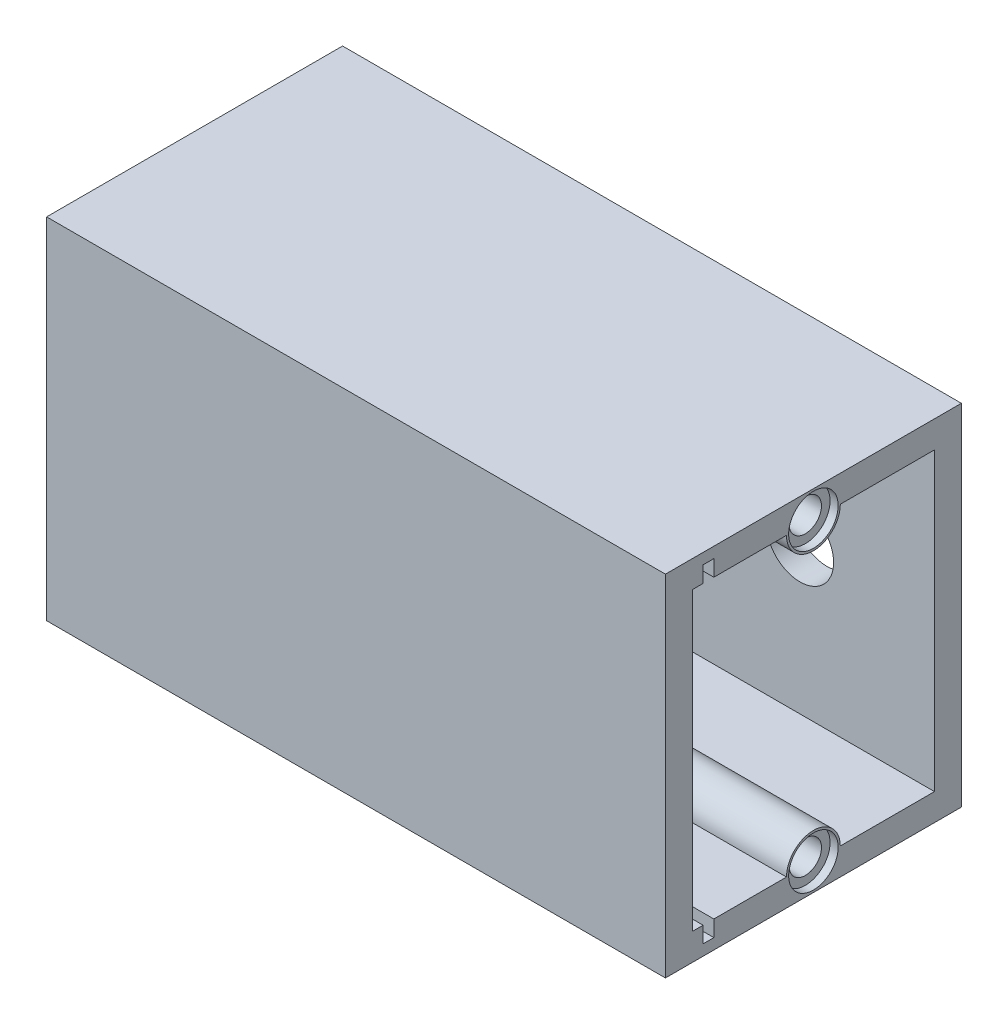
ISO-10303-21;
HEADER;
FILE_DESCRIPTION(('STEP AP214'),'2;1');
FILE_NAME('part.step','',(''),(''),'','','');
FILE_SCHEMA(('AUTOMOTIVE_DESIGN { 1 0 10303 214 1 1 1 1 }'));
ENDSEC;
DATA;
#1=APPLICATION_CONTEXT('core data for automotive mechanical design processes');
#2=APPLICATION_PROTOCOL_DEFINITION('international standard','automotive_design',2000,#1);
#3=PRODUCT_CONTEXT('',#1,'mechanical');
#4=PRODUCT('Part','Part','',(#3));
#5=PRODUCT_RELATED_PRODUCT_CATEGORY('part','',(#4));
#6=PRODUCT_DEFINITION_FORMATION('','',#4);
#7=PRODUCT_DEFINITION_CONTEXT('part definition',#1,'design');
#8=PRODUCT_DEFINITION('design','',#6,#7);
#9=PRODUCT_DEFINITION_SHAPE('','',#8);
#10=(LENGTH_UNIT() NAMED_UNIT(*) SI_UNIT(.MILLI.,.METRE.));
#11=(NAMED_UNIT(*) PLANE_ANGLE_UNIT() SI_UNIT($,.RADIAN.));
#12=(NAMED_UNIT(*) SI_UNIT($,.STERADIAN.) SOLID_ANGLE_UNIT());
#13=UNCERTAINTY_MEASURE_WITH_UNIT(LENGTH_MEASURE(1.E-05),#10,'distance_accuracy_value','');
#14=(GEOMETRIC_REPRESENTATION_CONTEXT(3) GLOBAL_UNCERTAINTY_ASSIGNED_CONTEXT((#13)) GLOBAL_UNIT_ASSIGNED_CONTEXT((#10,
#11,#12)) REPRESENTATION_CONTEXT('',''));
#15=CARTESIAN_POINT('',(0.,0.,0.));
#16=DIRECTION('',(0.,0.,1.));
#17=DIRECTION('',(1.,0.,0.));
#18=AXIS2_PLACEMENT_3D('',#15,#16,#17);
#19=CARTESIAN_POINT('',(0.,4.99999999999999,50.));
#20=DIRECTION('',(0.,-1.,0.));
#21=DIRECTION('',(1.,0.,0.));
#22=AXIS2_PLACEMENT_3D('',#19,#20,#21);
#23=PLANE('',#22);
#24=DIRECTION('',(0.,0.,-1.));
#25=VECTOR('',#24,1.);
#26=CARTESIAN_POINT('',(5.,4.99999999999999,50.));
#27=LINE('',#26,#25);
#28=CARTESIAN_POINT('',(5.,4.99999999999999,22.5));
#29=VERTEX_POINT('',#28);
#30=CARTESIAN_POINT('',(5.,4.99999999999999,5.));
#31=VERTEX_POINT('',#30);
#32=EDGE_CURVE('E193',#29,#31,#27,.T.);
#33=ORIENTED_EDGE('',*,*,#32,.F.);
#34=DIRECTION('',(1.,0.,0.));
#35=VECTOR('',#34,1.);
#36=CARTESIAN_POINT('',(-6.18033988749891,5.,22.5));
#37=LINE('',#36,#35);
#38=CARTESIAN_POINT('',(115.,5.,22.5));
#39=VERTEX_POINT('',#38);
#40=EDGE_CURVE('E192',#29,#39,#37,.T.);
#41=ORIENTED_EDGE('',*,*,#40,.T.);
#42=DIRECTION('',(0.,0.,-1.));
#43=VECTOR('',#42,1.);
#44=CARTESIAN_POINT('',(115.,5.,50.));
#45=LINE('',#44,#43);
#46=CARTESIAN_POINT('',(115.,5.,5.));
#47=VERTEX_POINT('',#46);
#48=EDGE_CURVE('E174',#39,#47,#45,.T.);
#49=ORIENTED_EDGE('',*,*,#48,.T.);
#50=DIRECTION('',(-1.,0.,0.));
#51=VECTOR('',#50,1.);
#52=CARTESIAN_POINT('',(0.,4.99999999999999,5.));
#53=LINE('',#52,#51);
#54=EDGE_CURVE('E276',#47,#31,#53,.T.);
#55=ORIENTED_EDGE('',*,*,#54,.T.);
#56=EDGE_LOOP('',(#33,#41,#49,#55));
#57=FACE_BOUND('',#56,.T.);
#58=ADVANCED_FACE('F35',(#57),#23,.F.);
#59=CARTESIAN_POINT('',(0.,60.,50.));
#60=DIRECTION('',(0.,1.,0.));
#61=DIRECTION('',(0.,0.,1.));
#62=AXIS2_PLACEMENT_3D('',#59,#60,#61);
#63=PLANE('',#62);
#64=DIRECTION('',(1.,0.,0.));
#65=VECTOR('',#64,1.);
#66=CARTESIAN_POINT('',(-6.18033988749891,60.,32.5));
#67=LINE('',#66,#65);
#68=CARTESIAN_POINT('',(5.,60.,32.5));
#69=VERTEX_POINT('',#68);
#70=CARTESIAN_POINT('',(115.,60.,32.5));
#71=VERTEX_POINT('',#70);
#72=EDGE_CURVE('E198',#69,#71,#67,.T.);
#73=ORIENTED_EDGE('',*,*,#72,.T.);
#74=DIRECTION('',(0.,0.,-1.));
#75=VECTOR('',#74,1.);
#76=CARTESIAN_POINT('',(115.,60.,50.));
#77=LINE('',#76,#75);
#78=CARTESIAN_POINT('',(115.,60.,46.));
#79=VERTEX_POINT('',#78);
#80=EDGE_CURVE('E302',#79,#71,#77,.T.);
#81=ORIENTED_EDGE('',*,*,#80,.F.);
#82=DIRECTION('',(-1.,0.,0.));
#83=VECTOR('',#82,1.);
#84=CARTESIAN_POINT('',(0.,60.,46.));
#85=LINE('',#84,#83);
#86=CARTESIAN_POINT('',(52.75,60.,46.));
#87=VERTEX_POINT('',#86);
#88=EDGE_CURVE('E240',#79,#87,#85,.T.);
#89=ORIENTED_EDGE('',*,*,#88,.T.);
#90=DIRECTION('',(0.,0.,-1.));
#91=VECTOR('',#90,1.);
#92=CARTESIAN_POINT('',(52.75,60.,50.));
#93=LINE('',#92,#91);
#94=CARTESIAN_POINT('',(52.75,60.,48.));
#95=VERTEX_POINT('',#94);
#96=EDGE_CURVE('E11',#95,#87,#93,.T.);
#97=ORIENTED_EDGE('',*,*,#96,.F.);
#98=DIRECTION('',(1.,0.,0.));
#99=VECTOR('',#98,1.);
#100=CARTESIAN_POINT('',(0.,60.,48.));
#101=LINE('',#100,#99);
#102=CARTESIAN_POINT('',(115.,60.,48.));
#103=VERTEX_POINT('',#102);
#104=EDGE_CURVE('E252',#95,#103,#101,.T.);
#105=ORIENTED_EDGE('',*,*,#104,.T.);
#106=CARTESIAN_POINT('',(115.,60.,50.));
#107=VERTEX_POINT('',#106);
#108=EDGE_CURVE('E298',#107,#103,#77,.T.);
#109=ORIENTED_EDGE('',*,*,#108,.F.);
#110=DIRECTION('',(1.,0.,0.));
#111=VECTOR('',#110,1.);
#112=CARTESIAN_POINT('',(0.,60.,50.));
#113=LINE('',#112,#111);
#114=CARTESIAN_POINT('',(5.,60.,50.));
#115=VERTEX_POINT('',#114);
#116=EDGE_CURVE('E283',#115,#107,#113,.T.);
#117=ORIENTED_EDGE('',*,*,#116,.F.);
#118=DIRECTION('',(0.,0.,-1.));
#119=VECTOR('',#118,1.);
#120=CARTESIAN_POINT('',(5.,60.,50.));
#121=LINE('',#120,#119);
#122=EDGE_CURVE('E303',#115,#69,#121,.T.);
#123=ORIENTED_EDGE('',*,*,#122,.T.);
#124=EDGE_LOOP('',(#73,#81,#89,#97,#105,#109,#117,#123));
#125=FACE_BOUND('',#124,.T.);
#126=ADVANCED_FACE('F388',(#125),#63,.F.);
#127=DIRECTION('',(1.,0.,0.));
#128=VECTOR('',#127,1.);
#129=CARTESIAN_POINT('',(-6.18033988749891,60.,22.5));
#130=LINE('',#129,#128);
#131=CARTESIAN_POINT('',(5.,60.,22.5));
#132=VERTEX_POINT('',#131);
#133=CARTESIAN_POINT('',(115.,60.,22.5));
#134=VERTEX_POINT('',#133);
#135=EDGE_CURVE('E201',#132,#134,#130,.T.);
#136=ORIENTED_EDGE('',*,*,#135,.F.);
#137=CARTESIAN_POINT('',(5.,60.,5.));
#138=VERTEX_POINT('',#137);
#139=EDGE_CURVE('E301',#132,#138,#121,.T.);
#140=ORIENTED_EDGE('',*,*,#139,.T.);
#141=DIRECTION('',(1.,0.,0.));
#142=VECTOR('',#141,1.);
#143=CARTESIAN_POINT('',(0.,60.,5.));
#144=LINE('',#143,#142);
#145=CARTESIAN_POINT('',(115.,60.,5.));
#146=VERTEX_POINT('',#145);
#147=EDGE_CURVE('E292',#138,#146,#144,.T.);
#148=ORIENTED_EDGE('',*,*,#147,.T.);
#149=EDGE_CURVE('E297',#134,#146,#77,.T.);
#150=ORIENTED_EDGE('',*,*,#149,.F.);
#151=EDGE_LOOP('',(#136,#140,#148,#150));
#152=FACE_BOUND('',#151,.T.);
#153=ADVANCED_FACE('F394',(#152),#63,.F.);
#154=CARTESIAN_POINT('',(0.,0.,0.));
#155=DIRECTION('',(0.,0.,-1.));
#156=DIRECTION('',(-1.,0.,0.));
#157=AXIS2_PLACEMENT_3D('',#154,#155,#156);
#158=PLANE('',#157);
#159=CARTESIAN_POINT('',(30.,32.5,0.));
#160=DIRECTION('',(0.,0.,1.));
#161=DIRECTION('',(1.,0.,0.));
#162=AXIS2_PLACEMENT_3D('',#159,#160,#161);
#163=CIRCLE('',#162,6.25);
#164=CARTESIAN_POINT('',(36.25,32.5,0.));
#165=VERTEX_POINT('',#164);
#166=EDGE_CURVE('E312',#165,#165,#163,.T.);
#167=ORIENTED_EDGE('',*,*,#166,.T.);
#168=EDGE_LOOP('',(#167));
#169=FACE_BOUND('',#168,.T.);
#170=CARTESIAN_POINT('',(90.,32.5,0.));
#171=DIRECTION('',(0.,0.,1.));
#172=DIRECTION('',(1.,0.,0.));
#173=AXIS2_PLACEMENT_3D('',#170,#171,#172);
#174=CIRCLE('',#173,6.25);
#175=CARTESIAN_POINT('',(96.25,32.5,0.));
#176=VERTEX_POINT('',#175);
#177=EDGE_CURVE('E308',#176,#176,#174,.T.);
#178=ORIENTED_EDGE('',*,*,#177,.T.);
#179=EDGE_LOOP('',(#178));
#180=FACE_BOUND('',#179,.T.);
#181=DIRECTION('',(-1.,0.,0.));
#182=VECTOR('',#181,1.);
#183=CARTESIAN_POINT('',(0.,65.,0.));
#184=LINE('',#183,#182);
#185=CARTESIAN_POINT('',(115.,65.,0.));
#186=VERTEX_POINT('',#185);
#187=CARTESIAN_POINT('',(0.,65.,0.));
#188=VERTEX_POINT('',#187);
#189=EDGE_CURVE('E326',#186,#188,#184,.T.);
#190=ORIENTED_EDGE('',*,*,#189,.F.);
#191=DIRECTION('',(0.,1.,0.));
#192=VECTOR('',#191,1.);
#193=CARTESIAN_POINT('',(115.,65.,0.));
#194=LINE('',#193,#192);
#195=CARTESIAN_POINT('',(115.,0.,0.));
#196=VERTEX_POINT('',#195);
#197=EDGE_CURVE('E264',#196,#186,#194,.T.);
#198=ORIENTED_EDGE('',*,*,#197,.F.);
#199=DIRECTION('',(1.,0.,0.));
#200=VECTOR('',#199,1.);
#201=CARTESIAN_POINT('',(0.,0.,0.));
#202=LINE('',#201,#200);
#203=CARTESIAN_POINT('',(0.,0.,0.));
#204=VERTEX_POINT('',#203);
#205=EDGE_CURVE('E323',#204,#196,#202,.T.);
#206=ORIENTED_EDGE('',*,*,#205,.F.);
#207=DIRECTION('',(0.,-1.,0.));
#208=VECTOR('',#207,1.);
#209=CARTESIAN_POINT('',(0.,0.,0.));
#210=LINE('',#209,#208);
#211=EDGE_CURVE('E318',#188,#204,#210,.T.);
#212=ORIENTED_EDGE('',*,*,#211,.F.);
#213=EDGE_LOOP('',(#190,#198,#206,#212));
#214=FACE_BOUND('',#213,.T.);
#215=ADVANCED_FACE('F553',(#169,#180,#214),#158,.T.);
#216=CARTESIAN_POINT('',(0.,0.,5.));
#217=DIRECTION('',(0.,1.,0.));
#218=DIRECTION('',(0.,0.,1.));
#219=AXIS2_PLACEMENT_3D('',#216,#217,#218);
#220=PLANE('',#219);
#221=DIRECTION('',(0.,0.,-1.));
#222=VECTOR('',#221,1.);
#223=CARTESIAN_POINT('',(115.,0.,55.));
#224=LINE('',#223,#222);
#225=CARTESIAN_POINT('',(115.,0.,55.));
#226=VERTEX_POINT('',#225);
#227=EDGE_CURVE('E262',#226,#196,#224,.T.);
#228=ORIENTED_EDGE('',*,*,#227,.F.);
#229=DIRECTION('',(1.,0.,0.));
#230=VECTOR('',#229,1.);
#231=CARTESIAN_POINT('',(0.,0.,55.));
#232=LINE('',#231,#230);
#233=CARTESIAN_POINT('',(0.,0.,55.));
#234=VERTEX_POINT('',#233);
#235=EDGE_CURVE('E271',#234,#226,#232,.T.);
#236=ORIENTED_EDGE('',*,*,#235,.F.);
#237=DIRECTION('',(0.,0.,-1.));
#238=VECTOR('',#237,1.);
#239=CARTESIAN_POINT('',(0.,0.,5.));
#240=LINE('',#239,#238);
#241=EDGE_CURVE('E331',#234,#204,#240,.T.);
#242=ORIENTED_EDGE('',*,*,#241,.T.);
#243=ORIENTED_EDGE('',*,*,#205,.T.);
#244=EDGE_LOOP('',(#228,#236,#242,#243));
#245=FACE_BOUND('',#244,.T.);
#246=ADVANCED_FACE('F662',(#245),#220,.F.);
#247=CARTESIAN_POINT('',(0.,65.,5.));
#248=DIRECTION('',(0.,-1.,0.));
#249=DIRECTION('',(0.,0.,-1.));
#250=AXIS2_PLACEMENT_3D('',#247,#248,#249);
#251=PLANE('',#250);
#252=DIRECTION('',(0.,0.,1.));
#253=VECTOR('',#252,1.);
#254=CARTESIAN_POINT('',(115.,65.,55.));
#255=LINE('',#254,#253);
#256=CARTESIAN_POINT('',(115.,65.,55.));
#257=VERTEX_POINT('',#256);
#258=EDGE_CURVE('E266',#186,#257,#255,.T.);
#259=ORIENTED_EDGE('',*,*,#258,.F.);
#260=ORIENTED_EDGE('',*,*,#189,.T.);
#261=DIRECTION('',(0.,0.,-1.));
#262=VECTOR('',#261,1.);
#263=CARTESIAN_POINT('',(0.,65.,5.));
#264=LINE('',#263,#262);
#265=CARTESIAN_POINT('',(0.,65.,55.));
#266=VERTEX_POINT('',#265);
#267=EDGE_CURVE('E328',#266,#188,#264,.T.);
#268=ORIENTED_EDGE('',*,*,#267,.F.);
#269=DIRECTION('',(-1.,0.,0.));
#270=VECTOR('',#269,1.);
#271=CARTESIAN_POINT('',(0.,65.,55.));
#272=LINE('',#271,#270);
#273=EDGE_CURVE('E274',#257,#266,#272,.T.);
#274=ORIENTED_EDGE('',*,*,#273,.F.);
#275=EDGE_LOOP('',(#259,#260,#268,#274));
#276=FACE_BOUND('',#275,.T.);
#277=ADVANCED_FACE('F479',(#276),#251,.F.);
#278=CARTESIAN_POINT('',(0.,0.,55.));
#279=DIRECTION('',(0.,0.,1.));
#280=DIRECTION('',(1.,0.,0.));
#281=AXIS2_PLACEMENT_3D('',#278,#279,#280);
#282=PLANE('',#281);
#283=ORIENTED_EDGE('',*,*,#235,.T.);
#284=DIRECTION('',(0.,-1.,0.));
#285=VECTOR('',#284,1.);
#286=CARTESIAN_POINT('',(115.,65.,55.));
#287=LINE('',#286,#285);
#288=EDGE_CURVE('E260',#257,#226,#287,.T.);
#289=ORIENTED_EDGE('',*,*,#288,.F.);
#290=ORIENTED_EDGE('',*,*,#273,.T.);
#291=DIRECTION('',(0.,-1.,0.));
#292=VECTOR('',#291,1.);
#293=CARTESIAN_POINT('',(0.,65.,55.));
#294=LINE('',#293,#292);
#295=EDGE_CURVE('E268',#266,#234,#294,.T.);
#296=ORIENTED_EDGE('',*,*,#295,.T.);
#297=EDGE_LOOP('',(#283,#289,#290,#296));
#298=FACE_BOUND('',#297,.T.);
#299=ADVANCED_FACE('F476',(#298),#282,.T.);
#300=CARTESIAN_POINT('',(0.,0.,5.));
#301=DIRECTION('',(0.,0.,-1.));
#302=DIRECTION('',(-1.,0.,0.));
#303=AXIS2_PLACEMENT_3D('',#300,#301,#302);
#304=PLANE('',#303);
#305=CARTESIAN_POINT('',(90.,32.5,5.));
#306=DIRECTION('',(0.,0.,1.));
#307=DIRECTION('',(1.,0.,0.));
#308=AXIS2_PLACEMENT_3D('',#305,#306,#307);
#309=CIRCLE('',#308,6.25);
#310=CARTESIAN_POINT('',(96.25,32.5,5.));
#311=VERTEX_POINT('',#310);
#312=EDGE_CURVE('E309',#311,#311,#309,.T.);
#313=ORIENTED_EDGE('',*,*,#312,.F.);
#314=EDGE_LOOP('',(#313));
#315=FACE_BOUND('',#314,.T.);
#316=CARTESIAN_POINT('',(30.,32.5,5.));
#317=DIRECTION('',(0.,0.,1.));
#318=DIRECTION('',(1.,0.,0.));
#319=AXIS2_PLACEMENT_3D('',#316,#317,#318);
#320=CIRCLE('',#319,6.25);
#321=CARTESIAN_POINT('',(36.25,32.5,5.));
#322=VERTEX_POINT('',#321);
#323=EDGE_CURVE('E315',#322,#322,#320,.T.);
#324=ORIENTED_EDGE('',*,*,#323,.F.);
#325=EDGE_LOOP('',(#324));
#326=FACE_BOUND('',#325,.T.);
#327=ORIENTED_EDGE('',*,*,#54,.F.);
#328=DIRECTION('',(0.,-1.,0.));
#329=VECTOR('',#328,1.);
#330=CARTESIAN_POINT('',(115.,0.,5.));
#331=LINE('',#330,#329);
#332=EDGE_CURVE('E183',#146,#47,#331,.T.);
#333=ORIENTED_EDGE('',*,*,#332,.F.);
#334=ORIENTED_EDGE('',*,*,#147,.F.);
#335=DIRECTION('',(0.,1.,0.));
#336=VECTOR('',#335,1.);
#337=CARTESIAN_POINT('',(5.,0.,5.));
#338=LINE('',#337,#336);
#339=EDGE_CURVE('E289',#31,#138,#338,.T.);
#340=ORIENTED_EDGE('',*,*,#339,.F.);
#341=EDGE_LOOP('',(#327,#333,#334,#340));
#342=FACE_BOUND('',#341,.T.);
#343=ADVANCED_FACE('F448',(#315,#326,#342),#304,.F.);
#344=CARTESIAN_POINT('',(0.,0.,5.));
#345=DIRECTION('',(1.,0.,0.));
#346=DIRECTION('',(0.,0.,-1.));
#347=AXIS2_PLACEMENT_3D('',#344,#345,#346);
#348=PLANE('',#347);
#349=ORIENTED_EDGE('',*,*,#211,.T.);
#350=ORIENTED_EDGE('',*,*,#241,.F.);
#351=ORIENTED_EDGE('',*,*,#295,.F.);
#352=ORIENTED_EDGE('',*,*,#267,.T.);
#353=EDGE_LOOP('',(#349,#350,#351,#352));
#354=FACE_BOUND('',#353,.T.);
#355=ADVANCED_FACE('F37',(#354),#348,.F.);
#356=CARTESIAN_POINT('',(30.,32.5,5.));
#357=DIRECTION('',(0.,0.,-1.));
#358=DIRECTION('',(-1.,0.,0.));
#359=AXIS2_PLACEMENT_3D('',#356,#357,#358);
#360=CYLINDRICAL_SURFACE('',#359,6.25);
#361=ORIENTED_EDGE('',*,*,#323,.T.);
#362=EDGE_LOOP('',(#361));
#363=FACE_BOUND('',#362,.T.);
#364=ORIENTED_EDGE('',*,*,#166,.F.);
#365=EDGE_LOOP('',(#364));
#366=FACE_BOUND('',#365,.T.);
#367=ADVANCED_FACE('F407',(#363,#366),#360,.F.);
#368=CARTESIAN_POINT('',(90.,32.5,5.));
#369=DIRECTION('',(0.,0.,-1.));
#370=DIRECTION('',(-1.,0.,0.));
#371=AXIS2_PLACEMENT_3D('',#368,#369,#370);
#372=CYLINDRICAL_SURFACE('',#371,6.25);
#373=ORIENTED_EDGE('',*,*,#312,.T.);
#374=EDGE_LOOP('',(#373));
#375=FACE_BOUND('',#374,.T.);
#376=ORIENTED_EDGE('',*,*,#177,.F.);
#377=EDGE_LOOP('',(#376));
#378=FACE_BOUND('',#377,.T.);
#379=ADVANCED_FACE('F401',(#375,#378),#372,.F.);
#380=CARTESIAN_POINT('',(115.,5.00000000000001,46.));
#381=VERTEX_POINT('',#380);
#382=CARTESIAN_POINT('',(115.,5.,32.5));
#383=VERTEX_POINT('',#382);
#384=EDGE_CURVE('E187',#381,#383,#45,.T.);
#385=ORIENTED_EDGE('',*,*,#384,.T.);
#386=DIRECTION('',(1.,0.,0.));
#387=VECTOR('',#386,1.);
#388=CARTESIAN_POINT('',(-6.18033988749891,5.,32.5));
#389=LINE('',#388,#387);
#390=CARTESIAN_POINT('',(5.,4.99999999999999,32.5));
#391=VERTEX_POINT('',#390);
#392=EDGE_CURVE('E60',#391,#383,#389,.T.);
#393=ORIENTED_EDGE('',*,*,#392,.F.);
#394=CARTESIAN_POINT('',(5.,4.99999999999999,50.));
#395=VERTEX_POINT('',#394);
#396=EDGE_CURVE('E306',#395,#391,#27,.T.);
#397=ORIENTED_EDGE('',*,*,#396,.F.);
#398=DIRECTION('',(-1.,0.,0.));
#399=VECTOR('',#398,1.);
#400=CARTESIAN_POINT('',(0.,4.99999999999999,50.));
#401=LINE('',#400,#399);
#402=CARTESIAN_POINT('',(115.,5.,50.));
#403=VERTEX_POINT('',#402);
#404=EDGE_CURVE('E277',#403,#395,#401,.T.);
#405=ORIENTED_EDGE('',*,*,#404,.F.);
#406=CARTESIAN_POINT('',(115.,5.00000000000001,48.));
#407=VERTEX_POINT('',#406);
#408=EDGE_CURVE('E190',#403,#407,#45,.T.);
#409=ORIENTED_EDGE('',*,*,#408,.T.);
#410=DIRECTION('',(-1.,0.,0.));
#411=VECTOR('',#410,1.);
#412=CARTESIAN_POINT('',(0.,4.99999999999999,48.));
#413=LINE('',#412,#411);
#414=CARTESIAN_POINT('',(52.75,5.,48.));
#415=VERTEX_POINT('',#414);
#416=EDGE_CURVE('E255',#407,#415,#413,.T.);
#417=ORIENTED_EDGE('',*,*,#416,.T.);
#418=DIRECTION('',(0.,0.,1.));
#419=VECTOR('',#418,1.);
#420=CARTESIAN_POINT('',(52.75,4.99999999999999,50.));
#421=LINE('',#420,#419);
#422=CARTESIAN_POINT('',(52.75,5.,46.));
#423=VERTEX_POINT('',#422);
#424=EDGE_CURVE('E258',#423,#415,#421,.T.);
#425=ORIENTED_EDGE('',*,*,#424,.F.);
#426=DIRECTION('',(1.,0.,0.));
#427=VECTOR('',#426,1.);
#428=CARTESIAN_POINT('',(0.,4.99999999999999,46.));
#429=LINE('',#428,#427);
#430=EDGE_CURVE('E249',#423,#381,#429,.T.);
#431=ORIENTED_EDGE('',*,*,#430,.T.);
#432=EDGE_LOOP('',(#385,#393,#397,#405,#409,#417,#425,#431));
#433=FACE_BOUND('',#432,.T.);
#434=ADVANCED_FACE('F390',(#433),#23,.F.);
#435=CARTESIAN_POINT('',(5.,0.,50.));
#436=DIRECTION('',(-1.,0.,0.));
#437=DIRECTION('',(0.,-1.,0.));
#438=AXIS2_PLACEMENT_3D('',#435,#436,#437);
#439=PLANE('',#438);
#440=ORIENTED_EDGE('',*,*,#396,.T.);
#441=CARTESIAN_POINT('',(5.,5.,27.5));
#442=DIRECTION('',(-1.,0.,0.));
#443=DIRECTION('',(0.,-1.,0.));
#444=AXIS2_PLACEMENT_3D('',#441,#442,#443);
#445=CIRCLE('',#444,5.);
#446=EDGE_CURVE('E52',#29,#391,#445,.F.);
#447=ORIENTED_EDGE('',*,*,#446,.F.);
#448=ORIENTED_EDGE('',*,*,#32,.T.);
#449=ORIENTED_EDGE('',*,*,#339,.T.);
#450=ORIENTED_EDGE('',*,*,#139,.F.);
#451=CARTESIAN_POINT('',(5.,60.,27.5));
#452=DIRECTION('',(-1.,0.,0.));
#453=DIRECTION('',(0.,-1.,0.));
#454=AXIS2_PLACEMENT_3D('',#451,#452,#453);
#455=CIRCLE('',#454,5.);
#456=EDGE_CURVE('E208',#132,#69,#455,.T.);
#457=ORIENTED_EDGE('',*,*,#456,.T.);
#458=ORIENTED_EDGE('',*,*,#122,.F.);
#459=DIRECTION('',(0.,1.,0.));
#460=VECTOR('',#459,1.);
#461=CARTESIAN_POINT('',(5.,0.,50.));
#462=LINE('',#461,#460);
#463=EDGE_CURVE('E280',#395,#115,#462,.T.);
#464=ORIENTED_EDGE('',*,*,#463,.F.);
#465=EDGE_LOOP('',(#440,#447,#448,#449,#450,#457,#458,#464));
#466=FACE_BOUND('',#465,.T.);
#467=ADVANCED_FACE('F400',(#466),#439,.F.);
#468=CARTESIAN_POINT('',(0.,0.,50.));
#469=DIRECTION('',(0.,0.,1.));
#470=DIRECTION('',(1.,0.,0.));
#471=AXIS2_PLACEMENT_3D('',#468,#469,#470);
#472=PLANE('',#471);
#473=DIRECTION('',(0.,-1.,0.));
#474=VECTOR('',#473,1.);
#475=CARTESIAN_POINT('',(115.,0.,50.));
#476=LINE('',#475,#474);
#477=EDGE_CURVE('E188',#107,#403,#476,.T.);
#478=ORIENTED_EDGE('',*,*,#477,.T.);
#479=ORIENTED_EDGE('',*,*,#404,.T.);
#480=ORIENTED_EDGE('',*,*,#463,.T.);
#481=ORIENTED_EDGE('',*,*,#116,.T.);
#482=EDGE_LOOP('',(#478,#479,#480,#481));
#483=FACE_BOUND('',#482,.T.);
#484=ADVANCED_FACE('F406',(#483),#472,.F.);
#485=CARTESIAN_POINT('',(115.,0.,0.));
#486=DIRECTION('',(1.,0.,0.));
#487=DIRECTION('',(0.,0.,-1.));
#488=AXIS2_PLACEMENT_3D('',#485,#486,#487);
#489=PLANE('',#488);
#490=CARTESIAN_POINT('',(115.,60.,27.5));
#491=DIRECTION('',(1.,0.,0.));
#492=DIRECTION('',(0.,0.,-1.));
#493=AXIS2_PLACEMENT_3D('',#490,#491,#492);
#494=CIRCLE('',#493,4.6);
#495=CARTESIAN_POINT('',(115.,60.,22.9));
#496=VERTEX_POINT('',#495);
#497=EDGE_CURVE('E345',#496,#496,#494,.T.);
#498=ORIENTED_EDGE('',*,*,#497,.F.);
#499=EDGE_LOOP('',(#498));
#500=FACE_BOUND('',#499,.T.);
#501=CARTESIAN_POINT('',(115.,5.,27.5));
#502=DIRECTION('',(1.,0.,0.));
#503=DIRECTION('',(0.,0.,-1.));
#504=AXIS2_PLACEMENT_3D('',#501,#502,#503);
#505=CIRCLE('',#504,4.6);
#506=CARTESIAN_POINT('',(115.,5.,22.9));
#507=VERTEX_POINT('',#506);
#508=EDGE_CURVE('E355',#507,#507,#505,.T.);
#509=ORIENTED_EDGE('',*,*,#508,.F.);
#510=EDGE_LOOP('',(#509));
#511=FACE_BOUND('',#510,.T.);
#512=DIRECTION('',(0.,-1.,0.));
#513=VECTOR('',#512,1.);
#514=CARTESIAN_POINT('',(115.,63.,48.));
#515=LINE('',#514,#513);
#516=CARTESIAN_POINT('',(115.,63.,48.));
#517=VERTEX_POINT('',#516);
#518=EDGE_CURVE('E211',#517,#103,#515,.T.);
#519=ORIENTED_EDGE('',*,*,#518,.F.);
#520=DIRECTION('',(0.,0.,1.));
#521=VECTOR('',#520,1.);
#522=CARTESIAN_POINT('',(115.,63.,48.));
#523=LINE('',#522,#521);
#524=CARTESIAN_POINT('',(115.,63.,46.));
#525=VERTEX_POINT('',#524);
#526=EDGE_CURVE('E235',#525,#517,#523,.T.);
#527=ORIENTED_EDGE('',*,*,#526,.F.);
#528=DIRECTION('',(0.,1.,0.));
#529=VECTOR('',#528,1.);
#530=CARTESIAN_POINT('',(115.,0.,46.));
#531=LINE('',#530,#529);
#532=EDGE_CURVE('E44',#79,#525,#531,.T.);
#533=ORIENTED_EDGE('',*,*,#532,.F.);
#534=ORIENTED_EDGE('',*,*,#80,.T.);
#535=CARTESIAN_POINT('',(115.,60.,27.5));
#536=DIRECTION('',(-1.,0.,0.));
#537=DIRECTION('',(0.,0.,1.));
#538=AXIS2_PLACEMENT_3D('',#535,#536,#537);
#539=CIRCLE('',#538,5.);
#540=EDGE_CURVE('E206',#134,#71,#539,.T.);
#541=ORIENTED_EDGE('',*,*,#540,.F.);
#542=ORIENTED_EDGE('',*,*,#149,.T.);
#543=ORIENTED_EDGE('',*,*,#332,.T.);
#544=ORIENTED_EDGE('',*,*,#48,.F.);
#545=CARTESIAN_POINT('',(115.,5.,27.5));
#546=DIRECTION('',(1.,0.,0.));
#547=DIRECTION('',(0.,0.,-1.));
#548=AXIS2_PLACEMENT_3D('',#545,#546,#547);
#549=CIRCLE('',#548,5.);
#550=EDGE_CURVE('E181',#39,#383,#549,.T.);
#551=ORIENTED_EDGE('',*,*,#550,.T.);
#552=ORIENTED_EDGE('',*,*,#384,.F.);
#553=DIRECTION('',(0.,1.,0.));
#554=VECTOR('',#553,1.);
#555=CARTESIAN_POINT('',(115.,63.,46.));
#556=LINE('',#555,#554);
#557=CARTESIAN_POINT('',(115.,2.,46.));
#558=VERTEX_POINT('',#557);
#559=EDGE_CURVE('E233',#558,#381,#556,.T.);
#560=ORIENTED_EDGE('',*,*,#559,.F.);
#561=DIRECTION('',(0.,0.,-1.));
#562=VECTOR('',#561,1.);
#563=CARTESIAN_POINT('',(115.,2.,48.));
#564=LINE('',#563,#562);
#565=CARTESIAN_POINT('',(115.,2.,48.));
#566=VERTEX_POINT('',#565);
#567=EDGE_CURVE('E230',#566,#558,#564,.T.);
#568=ORIENTED_EDGE('',*,*,#567,.F.);
#569=DIRECTION('',(0.,-1.,0.));
#570=VECTOR('',#569,1.);
#571=CARTESIAN_POINT('',(115.,0.,48.));
#572=LINE('',#571,#570);
#573=EDGE_CURVE('E334',#407,#566,#572,.T.);
#574=ORIENTED_EDGE('',*,*,#573,.F.);
#575=ORIENTED_EDGE('',*,*,#408,.F.);
#576=ORIENTED_EDGE('',*,*,#477,.F.);
#577=ORIENTED_EDGE('',*,*,#108,.T.);
#578=EDGE_LOOP('',(#519,#527,#533,#534,#541,#542,#543,#544,#551,#552,#560,#568,#574,#575,#576,#577));
#579=FACE_BOUND('',#578,.T.);
#580=ORIENTED_EDGE('',*,*,#288,.T.);
#581=ORIENTED_EDGE('',*,*,#227,.T.);
#582=ORIENTED_EDGE('',*,*,#197,.T.);
#583=ORIENTED_EDGE('',*,*,#258,.T.);
#584=EDGE_LOOP('',(#580,#581,#582,#583));
#585=FACE_BOUND('',#584,.T.);
#586=ADVANCED_FACE('F177',(#500,#511,#579,#585),#489,.T.);
#587=CARTESIAN_POINT('',(52.75,2.,48.));
#588=DIRECTION('',(0.,-1.,0.));
#589=DIRECTION('',(0.,0.,-1.));
#590=AXIS2_PLACEMENT_3D('',#587,#588,#589);
#591=PLANE('',#590);
#592=ORIENTED_EDGE('',*,*,#567,.T.);
#593=DIRECTION('',(1.,0.,0.));
#594=VECTOR('',#593,1.);
#595=CARTESIAN_POINT('',(52.75,2.,46.));
#596=LINE('',#595,#594);
#597=CARTESIAN_POINT('',(52.75,2.,46.));
#598=VERTEX_POINT('',#597);
#599=EDGE_CURVE('E244',#598,#558,#596,.T.);
#600=ORIENTED_EDGE('',*,*,#599,.F.);
#601=DIRECTION('',(0.,0.,-1.));
#602=VECTOR('',#601,1.);
#603=CARTESIAN_POINT('',(52.75,2.,48.));
#604=LINE('',#603,#602);
#605=CARTESIAN_POINT('',(52.75,2.,48.));
#606=VERTEX_POINT('',#605);
#607=EDGE_CURVE('E217',#606,#598,#604,.T.);
#608=ORIENTED_EDGE('',*,*,#607,.F.);
#609=DIRECTION('',(1.,0.,0.));
#610=VECTOR('',#609,1.);
#611=CARTESIAN_POINT('',(52.75,2.,48.));
#612=LINE('',#611,#610);
#613=EDGE_CURVE('E228',#606,#566,#612,.T.);
#614=ORIENTED_EDGE('',*,*,#613,.T.);
#615=EDGE_LOOP('',(#592,#600,#608,#614));
#616=FACE_BOUND('',#615,.T.);
#617=ADVANCED_FACE('F418',(#616),#591,.F.);
#618=CARTESIAN_POINT('',(52.75,63.,46.));
#619=DIRECTION('',(0.,0.,-1.));
#620=DIRECTION('',(0.,1.,0.));
#621=AXIS2_PLACEMENT_3D('',#618,#619,#620);
#622=PLANE('',#621);
#623=DIRECTION('',(0.,1.,0.));
#624=VECTOR('',#623,1.);
#625=CARTESIAN_POINT('',(52.75,63.,46.));
#626=LINE('',#625,#624);
#627=EDGE_CURVE('E222',#598,#423,#626,.T.);
#628=ORIENTED_EDGE('',*,*,#627,.F.);
#629=ORIENTED_EDGE('',*,*,#599,.T.);
#630=ORIENTED_EDGE('',*,*,#559,.T.);
#631=ORIENTED_EDGE('',*,*,#430,.F.);
#632=EDGE_LOOP('',(#628,#629,#630,#631));
#633=FACE_BOUND('',#632,.T.);
#634=ADVANCED_FACE('F415',(#633),#622,.F.);
#635=CARTESIAN_POINT('',(52.75,63.,48.));
#636=DIRECTION('',(0.,0.,1.));
#637=DIRECTION('',(0.,-1.,0.));
#638=AXIS2_PLACEMENT_3D('',#635,#636,#637);
#639=PLANE('',#638);
#640=ORIENTED_EDGE('',*,*,#573,.T.);
#641=ORIENTED_EDGE('',*,*,#613,.F.);
#642=DIRECTION('',(0.,-1.,0.));
#643=VECTOR('',#642,1.);
#644=CARTESIAN_POINT('',(52.75,63.,48.));
#645=LINE('',#644,#643);
#646=EDGE_CURVE('E218',#415,#606,#645,.T.);
#647=ORIENTED_EDGE('',*,*,#646,.F.);
#648=ORIENTED_EDGE('',*,*,#416,.F.);
#649=EDGE_LOOP('',(#640,#641,#647,#648));
#650=FACE_BOUND('',#649,.T.);
#651=ADVANCED_FACE('F422',(#650),#639,.F.);
#652=CARTESIAN_POINT('',(52.75,0.,0.));
#653=DIRECTION('',(1.,0.,0.));
#654=DIRECTION('',(0.,0.,-1.));
#655=AXIS2_PLACEMENT_3D('',#652,#653,#654);
#656=PLANE('',#655);
#657=ORIENTED_EDGE('',*,*,#424,.T.);
#658=ORIENTED_EDGE('',*,*,#646,.T.);
#659=ORIENTED_EDGE('',*,*,#607,.T.);
#660=ORIENTED_EDGE('',*,*,#627,.T.);
#661=EDGE_LOOP('',(#657,#658,#659,#660));
#662=FACE_BOUND('',#661,.T.);
#663=ADVANCED_FACE('F463',(#662),#656,.T.);
#664=ORIENTED_EDGE('',*,*,#96,.T.);
#665=CARTESIAN_POINT('',(52.75,63.,46.));
#666=VERTEX_POINT('',#665);
#667=EDGE_CURVE('E221',#87,#666,#626,.T.);
#668=ORIENTED_EDGE('',*,*,#667,.T.);
#669=DIRECTION('',(0.,0.,1.));
#670=VECTOR('',#669,1.);
#671=CARTESIAN_POINT('',(52.75,63.,48.));
#672=LINE('',#671,#670);
#673=CARTESIAN_POINT('',(52.75,63.,48.));
#674=VERTEX_POINT('',#673);
#675=EDGE_CURVE('E225',#666,#674,#672,.T.);
#676=ORIENTED_EDGE('',*,*,#675,.T.);
#677=EDGE_CURVE('E214',#674,#95,#645,.T.);
#678=ORIENTED_EDGE('',*,*,#677,.T.);
#679=EDGE_LOOP('',(#664,#668,#676,#678));
#680=FACE_BOUND('',#679,.T.);
#681=ADVANCED_FACE('F432',(#680),#656,.T.);
#682=ORIENTED_EDGE('',*,*,#677,.F.);
#683=DIRECTION('',(1.,0.,0.));
#684=VECTOR('',#683,1.);
#685=CARTESIAN_POINT('',(52.75,63.,48.));
#686=LINE('',#685,#684);
#687=EDGE_CURVE('E238',#674,#517,#686,.T.);
#688=ORIENTED_EDGE('',*,*,#687,.T.);
#689=ORIENTED_EDGE('',*,*,#518,.T.);
#690=ORIENTED_EDGE('',*,*,#104,.F.);
#691=EDGE_LOOP('',(#682,#688,#689,#690));
#692=FACE_BOUND('',#691,.T.);
#693=ADVANCED_FACE('F430',(#692),#639,.F.);
#694=ORIENTED_EDGE('',*,*,#532,.T.);
#695=DIRECTION('',(1.,0.,0.));
#696=VECTOR('',#695,1.);
#697=CARTESIAN_POINT('',(52.75,63.,46.));
#698=LINE('',#697,#696);
#699=EDGE_CURVE('E241',#666,#525,#698,.T.);
#700=ORIENTED_EDGE('',*,*,#699,.F.);
#701=ORIENTED_EDGE('',*,*,#667,.F.);
#702=ORIENTED_EDGE('',*,*,#88,.F.);
#703=EDGE_LOOP('',(#694,#700,#701,#702));
#704=FACE_BOUND('',#703,.T.);
#705=ADVANCED_FACE('F460',(#704),#622,.F.);
#706=CARTESIAN_POINT('',(52.75,63.,48.));
#707=DIRECTION('',(0.,1.,0.));
#708=DIRECTION('',(0.,0.,1.));
#709=AXIS2_PLACEMENT_3D('',#706,#707,#708);
#710=PLANE('',#709);
#711=ORIENTED_EDGE('',*,*,#526,.T.);
#712=ORIENTED_EDGE('',*,*,#687,.F.);
#713=ORIENTED_EDGE('',*,*,#675,.F.);
#714=ORIENTED_EDGE('',*,*,#699,.T.);
#715=EDGE_LOOP('',(#711,#712,#713,#714));
#716=FACE_BOUND('',#715,.T.);
#717=ADVANCED_FACE('F437',(#716),#710,.F.);
#718=CARTESIAN_POINT('',(-6.18033988749891,60.,27.5));
#719=DIRECTION('',(1.,0.,0.));
#720=DIRECTION('',(0.,0.,-1.));
#721=AXIS2_PLACEMENT_3D('',#718,#719,#720);
#722=CYLINDRICAL_SURFACE('',#721,5.);
#723=ORIENTED_EDGE('',*,*,#456,.F.);
#724=ORIENTED_EDGE('',*,*,#135,.T.);
#725=ORIENTED_EDGE('',*,*,#540,.T.);
#726=ORIENTED_EDGE('',*,*,#72,.F.);
#727=EDGE_LOOP('',(#723,#724,#725,#726));
#728=FACE_BOUND('',#727,.T.);
#729=ADVANCED_FACE('F452',(#728),#722,.T.);
#730=CARTESIAN_POINT('',(-6.18033988749891,5.,27.5));
#731=DIRECTION('',(1.,0.,0.));
#732=DIRECTION('',(0.,0.,-1.));
#733=AXIS2_PLACEMENT_3D('',#730,#731,#732);
#734=CYLINDRICAL_SURFACE('',#733,5.);
#735=ORIENTED_EDGE('',*,*,#40,.F.);
#736=ORIENTED_EDGE('',*,*,#446,.T.);
#737=ORIENTED_EDGE('',*,*,#392,.T.);
#738=ORIENTED_EDGE('',*,*,#550,.F.);
#739=EDGE_LOOP('',(#735,#736,#737,#738));
#740=FACE_BOUND('',#739,.T.);
#741=ADVANCED_FACE('F197',(#740),#734,.T.);
#742=CARTESIAN_POINT('',(113.5,60.,27.5));
#743=DIRECTION('',(1.,0.,0.));
#744=DIRECTION('',(0.,0.,-1.));
#745=AXIS2_PLACEMENT_3D('',#742,#743,#744);
#746=PLANE('',#745);
#747=CARTESIAN_POINT('',(113.5,60.,27.5));
#748=DIRECTION('',(1.,0.,0.));
#749=DIRECTION('',(0.,0.,-1.));
#750=AXIS2_PLACEMENT_3D('',#747,#748,#749);
#751=CIRCLE('',#750,4.6);
#752=CARTESIAN_POINT('',(113.5,60.,22.9));
#753=VERTEX_POINT('',#752);
#754=EDGE_CURVE('E339',#753,#753,#751,.T.);
#755=ORIENTED_EDGE('',*,*,#754,.T.);
#756=EDGE_LOOP('',(#755));
#757=FACE_BOUND('',#756,.T.);
#758=CARTESIAN_POINT('',(113.5,60.,27.5));
#759=DIRECTION('',(1.,0.,0.));
#760=DIRECTION('',(0.,0.,-1.));
#761=AXIS2_PLACEMENT_3D('',#758,#759,#760);
#762=CIRCLE('',#761,3.);
#763=CARTESIAN_POINT('',(113.5,60.,24.5));
#764=VERTEX_POINT('',#763);
#765=EDGE_CURVE('E337',#764,#764,#762,.F.);
#766=ORIENTED_EDGE('',*,*,#765,.T.);
#767=EDGE_LOOP('',(#766));
#768=FACE_BOUND('',#767,.T.);
#769=ADVANCED_FACE('F384',(#757,#768),#746,.T.);
#770=CARTESIAN_POINT('',(113.5,60.,27.5));
#771=DIRECTION('',(1.,0.,0.));
#772=DIRECTION('',(0.,0.,-1.));
#773=AXIS2_PLACEMENT_3D('',#770,#771,#772);
#774=CYLINDRICAL_SURFACE('',#773,4.6);
#775=ORIENTED_EDGE('',*,*,#754,.F.);
#776=EDGE_LOOP('',(#775));
#777=FACE_BOUND('',#776,.T.);
#778=ORIENTED_EDGE('',*,*,#497,.T.);
#779=EDGE_LOOP('',(#778));
#780=FACE_BOUND('',#779,.T.);
#781=ADVANCED_FACE('F374',(#777,#780),#774,.F.);
#782=CARTESIAN_POINT('',(113.5,5.,27.5));
#783=DIRECTION('',(1.,0.,0.));
#784=DIRECTION('',(0.,0.,-1.));
#785=AXIS2_PLACEMENT_3D('',#782,#783,#784);
#786=PLANE('',#785);
#787=CARTESIAN_POINT('',(113.5,5.,27.5));
#788=DIRECTION('',(1.,0.,0.));
#789=DIRECTION('',(0.,0.,-1.));
#790=AXIS2_PLACEMENT_3D('',#787,#788,#789);
#791=CIRCLE('',#790,4.6);
#792=CARTESIAN_POINT('',(113.5,5.,22.9));
#793=VERTEX_POINT('',#792);
#794=EDGE_CURVE('E350',#793,#793,#791,.T.);
#795=ORIENTED_EDGE('',*,*,#794,.T.);
#796=EDGE_LOOP('',(#795));
#797=FACE_BOUND('',#796,.T.);
#798=CARTESIAN_POINT('',(113.5,5.,27.5));
#799=DIRECTION('',(1.,0.,0.));
#800=DIRECTION('',(0.,0.,-1.));
#801=AXIS2_PLACEMENT_3D('',#798,#799,#800);
#802=CIRCLE('',#801,3.);
#803=CARTESIAN_POINT('',(113.5,5.,24.5));
#804=VERTEX_POINT('',#803);
#805=EDGE_CURVE('E39',#804,#804,#802,.F.);
#806=ORIENTED_EDGE('',*,*,#805,.T.);
#807=EDGE_LOOP('',(#806));
#808=FACE_BOUND('',#807,.T.);
#809=ADVANCED_FACE('F371',(#797,#808),#786,.T.);
#810=CARTESIAN_POINT('',(113.5,5.,27.5));
#811=DIRECTION('',(1.,0.,0.));
#812=DIRECTION('',(0.,0.,-1.));
#813=AXIS2_PLACEMENT_3D('',#810,#811,#812);
#814=CYLINDRICAL_SURFACE('',#813,4.6);
#815=ORIENTED_EDGE('',*,*,#794,.F.);
#816=EDGE_LOOP('',(#815));
#817=FACE_BOUND('',#816,.T.);
#818=ORIENTED_EDGE('',*,*,#508,.T.);
#819=EDGE_LOOP('',(#818));
#820=FACE_BOUND('',#819,.T.);
#821=ADVANCED_FACE('F373',(#817,#820),#814,.F.);
#822=CARTESIAN_POINT('',(103.,60.,27.5));
#823=DIRECTION('',(1.,0.,0.));
#824=DIRECTION('',(0.,0.,-1.));
#825=AXIS2_PLACEMENT_3D('',#822,#823,#824);
#826=PLANE('',#825);
#827=CARTESIAN_POINT('',(103.,60.,27.5));
#828=DIRECTION('',(1.,0.,0.));
#829=DIRECTION('',(0.,0.,-1.));
#830=AXIS2_PLACEMENT_3D('',#827,#828,#829);
#831=CIRCLE('',#830,3.);
#832=CARTESIAN_POINT('',(103.,60.,24.5));
#833=VERTEX_POINT('',#832);
#834=EDGE_CURVE('E195',#833,#833,#831,.T.);
#835=ORIENTED_EDGE('',*,*,#834,.T.);
#836=EDGE_LOOP('',(#835));
#837=FACE_BOUND('',#836,.T.);
#838=ADVANCED_FACE('F381',(#837),#826,.T.);
#839=CARTESIAN_POINT('',(103.,60.,27.5));
#840=DIRECTION('',(1.,0.,0.));
#841=DIRECTION('',(0.,0.,-1.));
#842=AXIS2_PLACEMENT_3D('',#839,#840,#841);
#843=CYLINDRICAL_SURFACE('',#842,3.);
#844=ORIENTED_EDGE('',*,*,#834,.F.);
#845=EDGE_LOOP('',(#844));
#846=FACE_BOUND('',#845,.T.);
#847=ORIENTED_EDGE('',*,*,#765,.F.);
#848=EDGE_LOOP('',(#847));
#849=FACE_BOUND('',#848,.T.);
#850=ADVANCED_FACE('F582',(#846,#849),#843,.F.);
#851=CARTESIAN_POINT('',(103.,5.,27.5));
#852=DIRECTION('',(1.,0.,0.));
#853=DIRECTION('',(0.,0.,-1.));
#854=AXIS2_PLACEMENT_3D('',#851,#852,#853);
#855=PLANE('',#854);
#856=CARTESIAN_POINT('',(103.,5.,27.5));
#857=DIRECTION('',(1.,0.,0.));
#858=DIRECTION('',(0.,0.,-1.));
#859=AXIS2_PLACEMENT_3D('',#856,#857,#858);
#860=CIRCLE('',#859,3.);
#861=CARTESIAN_POINT('',(103.,5.,24.5));
#862=VERTEX_POINT('',#861);
#863=EDGE_CURVE('E343',#862,#862,#860,.T.);
#864=ORIENTED_EDGE('',*,*,#863,.T.);
#865=EDGE_LOOP('',(#864));
#866=FACE_BOUND('',#865,.T.);
#867=ADVANCED_FACE('F363',(#866),#855,.T.);
#868=CARTESIAN_POINT('',(103.,5.,27.5));
#869=DIRECTION('',(1.,0.,0.));
#870=DIRECTION('',(0.,0.,-1.));
#871=AXIS2_PLACEMENT_3D('',#868,#869,#870);
#872=CYLINDRICAL_SURFACE('',#871,3.);
#873=ORIENTED_EDGE('',*,*,#863,.F.);
#874=EDGE_LOOP('',(#873));
#875=FACE_BOUND('',#874,.T.);
#876=ORIENTED_EDGE('',*,*,#805,.F.);
#877=EDGE_LOOP('',(#876));
#878=FACE_BOUND('',#877,.T.);
#879=ADVANCED_FACE('F365',(#875,#878),#872,.F.);
#880=CLOSED_SHELL('',(#58,#126,#153,#215,#246,#277,#299,#343,#355,#367,#379,#434,#467,#484,#586,
#617,#634,#651,#663,#681,#693,#705,#717,#729,#741,#769,#781,#809,#821,#838,#850,#867,#879));
#881=MANIFOLD_SOLID_BREP('B2',#880);
#882=ADVANCED_BREP_SHAPE_REPRESENTATION('',(#18,#881),#14);
#883=SHAPE_DEFINITION_REPRESENTATION(#9,#882);
ENDSEC;
END-ISO-10303-21;
